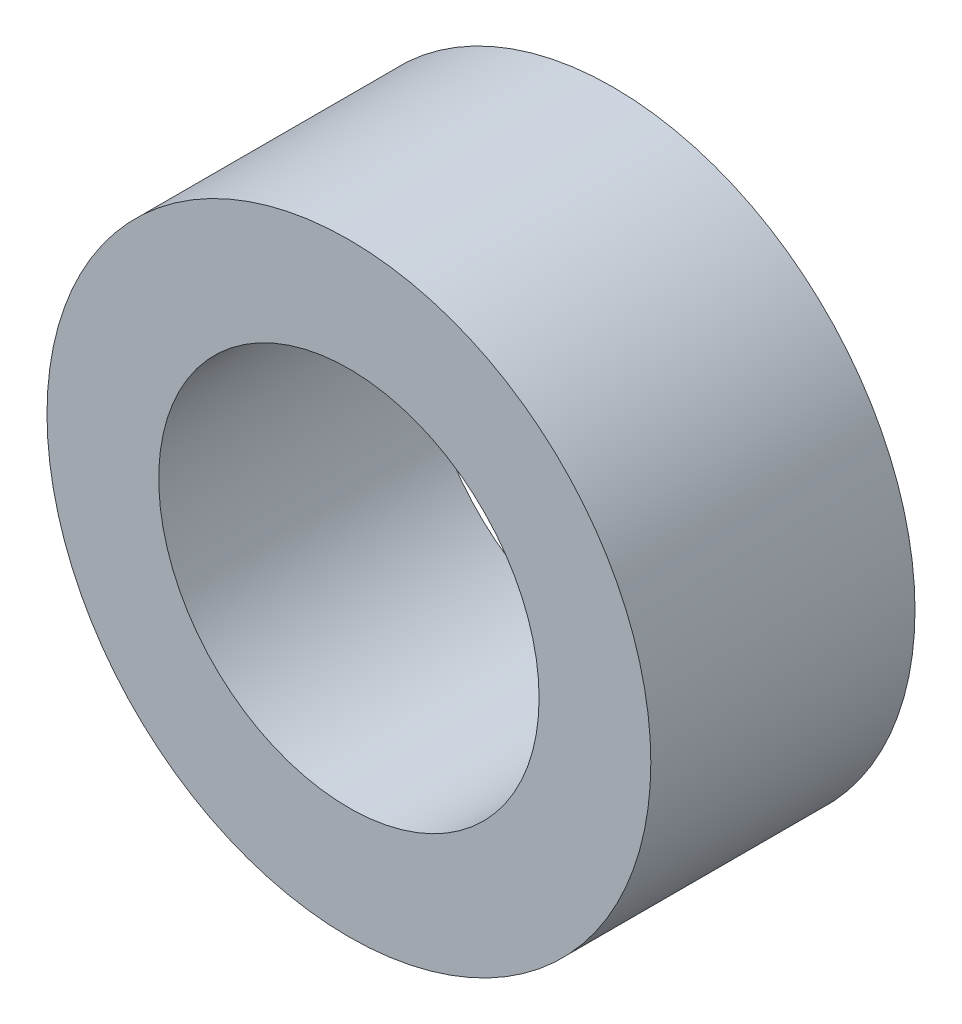
ISO-10303-21;
HEADER;
FILE_DESCRIPTION(('STEP AP214'),'2;1');
FILE_NAME('part.step','',(''),(''),'','','');
FILE_SCHEMA(('AUTOMOTIVE_DESIGN { 1 0 10303 214 1 1 1 1 }'));
ENDSEC;
DATA;
#1=APPLICATION_CONTEXT('core data for automotive mechanical design processes');
#2=APPLICATION_PROTOCOL_DEFINITION('international standard','automotive_design',2000,#1);
#3=PRODUCT_CONTEXT('',#1,'mechanical');
#4=PRODUCT('Part','Part','',(#3));
#5=PRODUCT_RELATED_PRODUCT_CATEGORY('part','',(#4));
#6=PRODUCT_DEFINITION_FORMATION('','',#4);
#7=PRODUCT_DEFINITION_CONTEXT('part definition',#1,'design');
#8=PRODUCT_DEFINITION('design','',#6,#7);
#9=PRODUCT_DEFINITION_SHAPE('','',#8);
#10=(LENGTH_UNIT() NAMED_UNIT(*) SI_UNIT(.MILLI.,.METRE.));
#11=(NAMED_UNIT(*) PLANE_ANGLE_UNIT() SI_UNIT($,.RADIAN.));
#12=(NAMED_UNIT(*) SI_UNIT($,.STERADIAN.) SOLID_ANGLE_UNIT());
#13=UNCERTAINTY_MEASURE_WITH_UNIT(LENGTH_MEASURE(1.E-05),#10,'distance_accuracy_value','');
#14=(GEOMETRIC_REPRESENTATION_CONTEXT(3) GLOBAL_UNCERTAINTY_ASSIGNED_CONTEXT((#13)) GLOBAL_UNIT_ASSIGNED_CONTEXT((#10,
#11,#12)) REPRESENTATION_CONTEXT('',''));
#15=CARTESIAN_POINT('',(0.,0.,0.));
#16=DIRECTION('',(0.,0.,1.));
#17=DIRECTION('',(1.,0.,0.));
#18=AXIS2_PLACEMENT_3D('',#15,#16,#17);
#19=CARTESIAN_POINT('',(216.050914922103,692.64244393749,9.55625000000022));
#20=DIRECTION('',(0.,0.,1.));
#21=DIRECTION('',(1.,0.,0.));
#22=AXIS2_PLACEMENT_3D('',#19,#20,#21);
#23=PLANE('',#22);
#24=CARTESIAN_POINT('',(216.050914922103,692.64244393749,9.55625000000022));
#25=DIRECTION('',(0.,0.,1.));
#26=DIRECTION('',(1.,0.,0.));
#27=AXIS2_PLACEMENT_3D('',#24,#25,#26);
#28=CIRCLE('',#27,6.34999999999999);
#29=CARTESIAN_POINT('',(222.400914922103,692.64244393749,9.55625000000022));
#30=VERTEX_POINT('',#29);
#31=EDGE_CURVE('E10',#30,#30,#28,.T.);
#32=ORIENTED_EDGE('',*,*,#31,.T.);
#33=EDGE_LOOP('',(#32));
#34=FACE_BOUND('',#33,.T.);
#35=CARTESIAN_POINT('',(216.050914922103,692.64244393749,9.55625000000022));
#36=DIRECTION('',(0.,0.,1.));
#37=DIRECTION('',(1.,0.,0.));
#38=AXIS2_PLACEMENT_3D('',#35,#36,#37);
#39=CIRCLE('',#38,4.00000000000002);
#40=CARTESIAN_POINT('',(220.050914922103,692.64244393749,9.55625000000022));
#41=VERTEX_POINT('',#40);
#42=EDGE_CURVE('E42',#41,#41,#39,.T.);
#43=ORIENTED_EDGE('',*,*,#42,.F.);
#44=EDGE_LOOP('',(#43));
#45=FACE_BOUND('',#44,.T.);
#46=ADVANCED_FACE('F31',(#34,#45),#23,.T.);
#47=CARTESIAN_POINT('',(216.050914922103,692.64244393749,4.00000000000022));
#48=DIRECTION('',(0.,0.,1.));
#49=DIRECTION('',(1.,0.,0.));
#50=AXIS2_PLACEMENT_3D('',#47,#48,#49);
#51=PLANE('',#50);
#52=CARTESIAN_POINT('',(216.050914922103,692.64244393749,4.00000000000022));
#53=DIRECTION('',(0.,0.,1.));
#54=DIRECTION('',(1.,0.,0.));
#55=AXIS2_PLACEMENT_3D('',#52,#53,#54);
#56=CIRCLE('',#55,6.34999999999999);
#57=CARTESIAN_POINT('',(222.400914922103,692.64244393749,4.00000000000022));
#58=VERTEX_POINT('',#57);
#59=EDGE_CURVE('E35',#58,#58,#56,.T.);
#60=ORIENTED_EDGE('',*,*,#59,.F.);
#61=EDGE_LOOP('',(#60));
#62=FACE_BOUND('',#61,.T.);
#63=CARTESIAN_POINT('',(216.050914922103,692.64244393749,4.00000000000022));
#64=DIRECTION('',(0.,0.,1.));
#65=DIRECTION('',(1.,0.,0.));
#66=AXIS2_PLACEMENT_3D('',#63,#64,#65);
#67=CIRCLE('',#66,4.00000000000002);
#68=CARTESIAN_POINT('',(220.050914922103,692.64244393749,4.00000000000022));
#69=VERTEX_POINT('',#68);
#70=EDGE_CURVE('E44',#69,#69,#67,.T.);
#71=ORIENTED_EDGE('',*,*,#70,.T.);
#72=EDGE_LOOP('',(#71));
#73=FACE_BOUND('',#72,.T.);
#74=ADVANCED_FACE('F54',(#62,#73),#51,.F.);
#75=CARTESIAN_POINT('',(216.050914922103,692.64244393749,9.55625000000022));
#76=DIRECTION('',(0.,0.,-1.));
#77=DIRECTION('',(-1.,0.,0.));
#78=AXIS2_PLACEMENT_3D('',#75,#76,#77);
#79=CYLINDRICAL_SURFACE('',#78,6.34999999999999);
#80=ORIENTED_EDGE('',*,*,#31,.F.);
#81=EDGE_LOOP('',(#80));
#82=FACE_BOUND('',#81,.T.);
#83=ORIENTED_EDGE('',*,*,#59,.T.);
#84=EDGE_LOOP('',(#83));
#85=FACE_BOUND('',#84,.T.);
#86=ADVANCED_FACE('F33',(#82,#85),#79,.T.);
#87=CARTESIAN_POINT('',(216.050914922103,692.64244393749,9.55625000000022));
#88=DIRECTION('',(0.,0.,-1.));
#89=DIRECTION('',(-1.,0.,0.));
#90=AXIS2_PLACEMENT_3D('',#87,#88,#89);
#91=CYLINDRICAL_SURFACE('',#90,4.00000000000002);
#92=ORIENTED_EDGE('',*,*,#42,.T.);
#93=EDGE_LOOP('',(#92));
#94=FACE_BOUND('',#93,.T.);
#95=ORIENTED_EDGE('',*,*,#70,.F.);
#96=EDGE_LOOP('',(#95));
#97=FACE_BOUND('',#96,.T.);
#98=ADVANCED_FACE('F50',(#94,#97),#91,.F.);
#99=CLOSED_SHELL('',(#46,#74,#86,#98));
#100=MANIFOLD_SOLID_BREP('B2',#99);
#101=ADVANCED_BREP_SHAPE_REPRESENTATION('',(#18,#100),#14);
#102=SHAPE_DEFINITION_REPRESENTATION(#9,#101);
ENDSEC;
END-ISO-10303-21;
